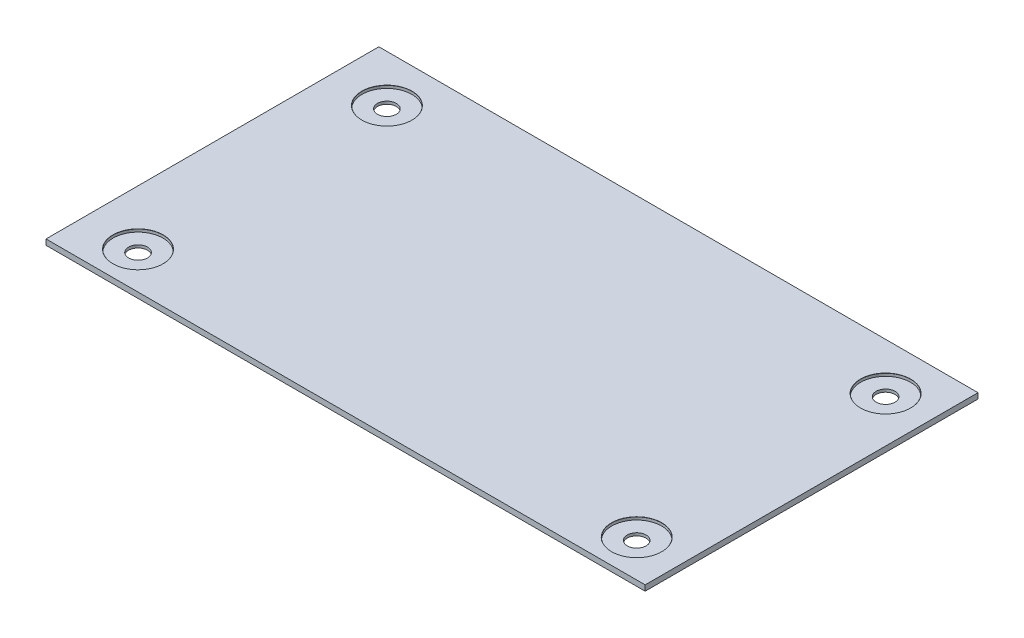
ISO-10303-21;
HEADER;
FILE_DESCRIPTION(('STEP AP214'),'2;1');
FILE_NAME('part.step','',(''),(''),'','','');
FILE_SCHEMA(('AUTOMOTIVE_DESIGN { 1 0 10303 214 1 1 1 1 }'));
ENDSEC;
DATA;
#1=APPLICATION_CONTEXT('core data for automotive mechanical design processes');
#2=APPLICATION_PROTOCOL_DEFINITION('international standard','automotive_design',2000,#1);
#3=PRODUCT_CONTEXT('',#1,'mechanical');
#4=PRODUCT('Part','Part','',(#3));
#5=PRODUCT_RELATED_PRODUCT_CATEGORY('part','',(#4));
#6=PRODUCT_DEFINITION_FORMATION('','',#4);
#7=PRODUCT_DEFINITION_CONTEXT('part definition',#1,'design');
#8=PRODUCT_DEFINITION('design','',#6,#7);
#9=PRODUCT_DEFINITION_SHAPE('','',#8);
#10=(LENGTH_UNIT() NAMED_UNIT(*) SI_UNIT(.MILLI.,.METRE.));
#11=(NAMED_UNIT(*) PLANE_ANGLE_UNIT() SI_UNIT($,.RADIAN.));
#12=(NAMED_UNIT(*) SI_UNIT($,.STERADIAN.) SOLID_ANGLE_UNIT());
#13=UNCERTAINTY_MEASURE_WITH_UNIT(LENGTH_MEASURE(1.E-05),#10,'distance_accuracy_value','');
#14=(GEOMETRIC_REPRESENTATION_CONTEXT(3) GLOBAL_UNCERTAINTY_ASSIGNED_CONTEXT((#13)) GLOBAL_UNIT_ASSIGNED_CONTEXT((#10,
#11,#12)) REPRESENTATION_CONTEXT('',''));
#15=CARTESIAN_POINT('',(0.,0.,0.));
#16=DIRECTION('',(0.,0.,1.));
#17=DIRECTION('',(1.,0.,0.));
#18=AXIS2_PLACEMENT_3D('',#15,#16,#17);
#19=CARTESIAN_POINT('',(-54.,1.,-30.));
#20=DIRECTION('',(1.,0.,0.));
#21=DIRECTION('',(0.,0.,-1.));
#22=AXIS2_PLACEMENT_3D('',#19,#20,#21);
#23=PLANE('',#22);
#24=DIRECTION('',(0.,0.,1.));
#25=VECTOR('',#24,1.);
#26=CARTESIAN_POINT('',(-54.,0.,-30.));
#27=LINE('',#26,#25);
#28=CARTESIAN_POINT('',(-54.,0.,-30.));
#29=VERTEX_POINT('',#28);
#30=CARTESIAN_POINT('',(-54.,0.,30.));
#31=VERTEX_POINT('',#30);
#32=EDGE_CURVE('E98',#29,#31,#27,.T.);
#33=ORIENTED_EDGE('',*,*,#32,.T.);
#34=DIRECTION('',(0.,-1.,0.));
#35=VECTOR('',#34,1.);
#36=CARTESIAN_POINT('',(-54.,1.,30.));
#37=LINE('',#36,#35);
#38=CARTESIAN_POINT('',(-54.,1.,30.));
#39=VERTEX_POINT('',#38);
#40=EDGE_CURVE('E11',#39,#31,#37,.T.);
#41=ORIENTED_EDGE('',*,*,#40,.F.);
#42=DIRECTION('',(0.,0.,1.));
#43=VECTOR('',#42,1.);
#44=CARTESIAN_POINT('',(-54.,1.,-30.));
#45=LINE('',#44,#43);
#46=CARTESIAN_POINT('',(-54.,1.,-30.));
#47=VERTEX_POINT('',#46);
#48=EDGE_CURVE('E86',#47,#39,#45,.T.);
#49=ORIENTED_EDGE('',*,*,#48,.F.);
#50=DIRECTION('',(0.,-1.,0.));
#51=VECTOR('',#50,1.);
#52=CARTESIAN_POINT('',(-54.,1.,-30.));
#53=LINE('',#52,#51);
#54=EDGE_CURVE('E94',#47,#29,#53,.T.);
#55=ORIENTED_EDGE('',*,*,#54,.T.);
#56=EDGE_LOOP('',(#33,#41,#49,#55));
#57=FACE_BOUND('',#56,.T.);
#58=ADVANCED_FACE('F35',(#57),#23,.F.);
#59=CARTESIAN_POINT('',(-54.,1.,30.));
#60=DIRECTION('',(0.,0.,-1.));
#61=DIRECTION('',(-1.,0.,0.));
#62=AXIS2_PLACEMENT_3D('',#59,#60,#61);
#63=PLANE('',#62);
#64=DIRECTION('',(1.,0.,0.));
#65=VECTOR('',#64,1.);
#66=CARTESIAN_POINT('',(-54.,0.,30.));
#67=LINE('',#66,#65);
#68=CARTESIAN_POINT('',(54.,0.,30.));
#69=VERTEX_POINT('',#68);
#70=EDGE_CURVE('E90',#31,#69,#67,.T.);
#71=ORIENTED_EDGE('',*,*,#70,.T.);
#72=DIRECTION('',(0.,-1.,0.));
#73=VECTOR('',#72,1.);
#74=CARTESIAN_POINT('',(54.,1.,30.));
#75=LINE('',#74,#73);
#76=CARTESIAN_POINT('',(54.,1.,30.));
#77=VERTEX_POINT('',#76);
#78=EDGE_CURVE('E43',#77,#69,#75,.T.);
#79=ORIENTED_EDGE('',*,*,#78,.F.);
#80=DIRECTION('',(1.,0.,0.));
#81=VECTOR('',#80,1.);
#82=CARTESIAN_POINT('',(-54.,1.,30.));
#83=LINE('',#82,#81);
#84=EDGE_CURVE('E81',#39,#77,#83,.T.);
#85=ORIENTED_EDGE('',*,*,#84,.F.);
#86=ORIENTED_EDGE('',*,*,#40,.T.);
#87=EDGE_LOOP('',(#71,#79,#85,#86));
#88=FACE_BOUND('',#87,.T.);
#89=ADVANCED_FACE('F89',(#88),#63,.F.);
#90=CARTESIAN_POINT('',(54.,1.,-30.));
#91=DIRECTION('',(-1.,0.,0.));
#92=DIRECTION('',(0.,0.,1.));
#93=AXIS2_PLACEMENT_3D('',#90,#91,#92);
#94=PLANE('',#93);
#95=DIRECTION('',(0.,0.,-1.));
#96=VECTOR('',#95,1.);
#97=CARTESIAN_POINT('',(54.,0.,-30.));
#98=LINE('',#97,#96);
#99=CARTESIAN_POINT('',(54.,0.,-30.));
#100=VERTEX_POINT('',#99);
#101=EDGE_CURVE('E68',#69,#100,#98,.T.);
#102=ORIENTED_EDGE('',*,*,#101,.T.);
#103=DIRECTION('',(0.,-1.,0.));
#104=VECTOR('',#103,1.);
#105=CARTESIAN_POINT('',(54.,1.,-30.));
#106=LINE('',#105,#104);
#107=CARTESIAN_POINT('',(54.,1.,-30.));
#108=VERTEX_POINT('',#107);
#109=EDGE_CURVE('E91',#108,#100,#106,.T.);
#110=ORIENTED_EDGE('',*,*,#109,.F.);
#111=DIRECTION('',(0.,0.,-1.));
#112=VECTOR('',#111,1.);
#113=CARTESIAN_POINT('',(54.,1.,-30.));
#114=LINE('',#113,#112);
#115=EDGE_CURVE('E84',#77,#108,#114,.T.);
#116=ORIENTED_EDGE('',*,*,#115,.F.);
#117=ORIENTED_EDGE('',*,*,#78,.T.);
#118=EDGE_LOOP('',(#102,#110,#116,#117));
#119=FACE_BOUND('',#118,.T.);
#120=ADVANCED_FACE('F92',(#119),#94,.F.);
#121=CARTESIAN_POINT('',(-54.,1.,-30.));
#122=DIRECTION('',(0.,0.,1.));
#123=DIRECTION('',(1.,0.,0.));
#124=AXIS2_PLACEMENT_3D('',#121,#122,#123);
#125=PLANE('',#124);
#126=DIRECTION('',(-1.,0.,0.));
#127=VECTOR('',#126,1.);
#128=CARTESIAN_POINT('',(-54.,0.,-30.));
#129=LINE('',#128,#127);
#130=EDGE_CURVE('E74',#100,#29,#129,.T.);
#131=ORIENTED_EDGE('',*,*,#130,.T.);
#132=ORIENTED_EDGE('',*,*,#54,.F.);
#133=DIRECTION('',(-1.,0.,0.));
#134=VECTOR('',#133,1.);
#135=CARTESIAN_POINT('',(-54.,1.,-30.));
#136=LINE('',#135,#134);
#137=EDGE_CURVE('E51',#108,#47,#136,.T.);
#138=ORIENTED_EDGE('',*,*,#137,.F.);
#139=ORIENTED_EDGE('',*,*,#109,.T.);
#140=EDGE_LOOP('',(#131,#132,#138,#139));
#141=FACE_BOUND('',#140,.T.);
#142=ADVANCED_FACE('F106',(#141),#125,.F.);
#143=CARTESIAN_POINT('',(0.,1.,0.));
#144=DIRECTION('',(0.,1.,0.));
#145=DIRECTION('',(0.,0.,1.));
#146=AXIS2_PLACEMENT_3D('',#143,#144,#145);
#147=PLANE('',#146);
#148=CARTESIAN_POINT('',(-44.0849623429926,1.,-21.5390915492151));
#149=DIRECTION('',(0.,1.,0.));
#150=DIRECTION('',(0.,0.,1.));
#151=AXIS2_PLACEMENT_3D('',#148,#149,#150);
#152=CIRCLE('',#151,4.525);
#153=CARTESIAN_POINT('',(-44.0849623429926,1.,-17.0140915492151));
#154=VERTEX_POINT('',#153);
#155=EDGE_CURVE('E168',#154,#154,#152,.T.);
#156=ORIENTED_EDGE('',*,*,#155,.F.);
#157=EDGE_LOOP('',(#156));
#158=FACE_BOUND('',#157,.T.);
#159=CARTESIAN_POINT('',(45.8031338926475,1.,-21.5390915492151));
#160=DIRECTION('',(0.,1.,0.));
#161=DIRECTION('',(0.,0.,1.));
#162=AXIS2_PLACEMENT_3D('',#159,#160,#161);
#163=CIRCLE('',#162,4.525);
#164=CARTESIAN_POINT('',(45.8031338926475,1.,-17.0140915492151));
#165=VERTEX_POINT('',#164);
#166=EDGE_CURVE('E153',#165,#165,#163,.T.);
#167=ORIENTED_EDGE('',*,*,#166,.F.);
#168=EDGE_LOOP('',(#167));
#169=FACE_BOUND('',#168,.T.);
#170=CARTESIAN_POINT('',(-44.0849623429926,1.,23.3247103117549));
#171=DIRECTION('',(0.,1.,0.));
#172=DIRECTION('',(0.,0.,1.));
#173=AXIS2_PLACEMENT_3D('',#170,#171,#172);
#174=CIRCLE('',#173,4.525);
#175=CARTESIAN_POINT('',(-44.0849623429926,1.,27.8497103117549));
#176=VERTEX_POINT('',#175);
#177=EDGE_CURVE('E138',#176,#176,#174,.T.);
#178=ORIENTED_EDGE('',*,*,#177,.F.);
#179=EDGE_LOOP('',(#178));
#180=FACE_BOUND('',#179,.T.);
#181=CARTESIAN_POINT('',(45.8031338926475,1.,23.3247103117549));
#182=DIRECTION('',(0.,1.,0.));
#183=DIRECTION('',(0.,0.,1.));
#184=AXIS2_PLACEMENT_3D('',#181,#182,#183);
#185=CIRCLE('',#184,4.525);
#186=CARTESIAN_POINT('',(45.8031338926475,1.,27.8497103117549));
#187=VERTEX_POINT('',#186);
#188=EDGE_CURVE('E123',#187,#187,#185,.T.);
#189=ORIENTED_EDGE('',*,*,#188,.F.);
#190=EDGE_LOOP('',(#189));
#191=FACE_BOUND('',#190,.T.);
#192=ORIENTED_EDGE('',*,*,#48,.T.);
#193=ORIENTED_EDGE('',*,*,#84,.T.);
#194=ORIENTED_EDGE('',*,*,#115,.T.);
#195=ORIENTED_EDGE('',*,*,#137,.T.);
#196=EDGE_LOOP('',(#192,#193,#194,#195));
#197=FACE_BOUND('',#196,.T.);
#198=ADVANCED_FACE('F82',(#158,#169,#180,#191,#197),#147,.T.);
#199=CARTESIAN_POINT('',(0.,0.,0.));
#200=DIRECTION('',(0.,1.,0.));
#201=DIRECTION('',(0.,0.,1.));
#202=AXIS2_PLACEMENT_3D('',#199,#200,#201);
#203=PLANE('',#202);
#204=CARTESIAN_POINT('',(-44.0849623429926,0.,-21.5390915492151));
#205=DIRECTION('',(0.,1.,0.));
#206=DIRECTION('',(0.,0.,1.));
#207=AXIS2_PLACEMENT_3D('',#204,#205,#206);
#208=CIRCLE('',#207,1.7);
#209=CARTESIAN_POINT('',(-44.0849623429926,0.,-19.8390915492151));
#210=VERTEX_POINT('',#209);
#211=EDGE_CURVE('E156',#210,#210,#208,.T.);
#212=ORIENTED_EDGE('',*,*,#211,.T.);
#213=EDGE_LOOP('',(#212));
#214=FACE_BOUND('',#213,.T.);
#215=CARTESIAN_POINT('',(45.8031338926475,0.,-21.5390915492151));
#216=DIRECTION('',(0.,1.,0.));
#217=DIRECTION('',(0.,0.,1.));
#218=AXIS2_PLACEMENT_3D('',#215,#216,#217);
#219=CIRCLE('',#218,1.7);
#220=CARTESIAN_POINT('',(45.8031338926475,0.,-19.8390915492151));
#221=VERTEX_POINT('',#220);
#222=EDGE_CURVE('E141',#221,#221,#219,.T.);
#223=ORIENTED_EDGE('',*,*,#222,.T.);
#224=EDGE_LOOP('',(#223));
#225=FACE_BOUND('',#224,.T.);
#226=CARTESIAN_POINT('',(-44.0849623429926,0.,23.3247103117549));
#227=DIRECTION('',(0.,1.,0.));
#228=DIRECTION('',(0.,0.,1.));
#229=AXIS2_PLACEMENT_3D('',#226,#227,#228);
#230=CIRCLE('',#229,1.7);
#231=CARTESIAN_POINT('',(-44.0849623429926,0.,25.0247103117549));
#232=VERTEX_POINT('',#231);
#233=EDGE_CURVE('E126',#232,#232,#230,.T.);
#234=ORIENTED_EDGE('',*,*,#233,.T.);
#235=EDGE_LOOP('',(#234));
#236=FACE_BOUND('',#235,.T.);
#237=CARTESIAN_POINT('',(45.8031338926475,0.,23.3247103117549));
#238=DIRECTION('',(0.,1.,0.));
#239=DIRECTION('',(0.,0.,1.));
#240=AXIS2_PLACEMENT_3D('',#237,#238,#239);
#241=CIRCLE('',#240,1.7);
#242=CARTESIAN_POINT('',(45.8031338926475,0.,25.0247103117549));
#243=VERTEX_POINT('',#242);
#244=EDGE_CURVE('E101',#243,#243,#241,.T.);
#245=ORIENTED_EDGE('',*,*,#244,.T.);
#246=EDGE_LOOP('',(#245));
#247=FACE_BOUND('',#246,.T.);
#248=ORIENTED_EDGE('',*,*,#32,.F.);
#249=ORIENTED_EDGE('',*,*,#130,.F.);
#250=ORIENTED_EDGE('',*,*,#101,.F.);
#251=ORIENTED_EDGE('',*,*,#70,.F.);
#252=EDGE_LOOP('',(#248,#249,#250,#251));
#253=FACE_BOUND('',#252,.T.);
#254=ADVANCED_FACE('F109',(#214,#225,#236,#247,#253),#203,.F.);
#255=CARTESIAN_POINT('',(45.8031338926475,1.,23.3247103117549));
#256=DIRECTION('',(0.,1.,0.));
#257=DIRECTION('',(0.,0.,1.));
#258=AXIS2_PLACEMENT_3D('',#255,#256,#257);
#259=CYLINDRICAL_SURFACE('',#258,1.7);
#260=ORIENTED_EDGE('',*,*,#244,.F.);
#261=EDGE_LOOP('',(#260));
#262=FACE_BOUND('',#261,.T.);
#263=CARTESIAN_POINT('',(45.8031338926475,0.5,23.3247103117549));
#264=DIRECTION('',(0.,1.,0.));
#265=DIRECTION('',(0.,0.,1.));
#266=AXIS2_PLACEMENT_3D('',#263,#264,#265);
#267=CIRCLE('',#266,1.7);
#268=CARTESIAN_POINT('',(45.8031338926475,0.5,25.0247103117549));
#269=VERTEX_POINT('',#268);
#270=EDGE_CURVE('E114',#269,#269,#267,.T.);
#271=ORIENTED_EDGE('',*,*,#270,.T.);
#272=EDGE_LOOP('',(#271));
#273=FACE_BOUND('',#272,.T.);
#274=ADVANCED_FACE('F212',(#262,#273),#259,.F.);
#275=CARTESIAN_POINT('',(50.3031338926475,0.5,23.3247103117549));
#276=DIRECTION('',(0.,-1.,0.));
#277=DIRECTION('',(0.,0.,-1.));
#278=AXIS2_PLACEMENT_3D('',#275,#276,#277);
#279=PLANE('',#278);
#280=ORIENTED_EDGE('',*,*,#270,.F.);
#281=EDGE_LOOP('',(#280));
#282=FACE_BOUND('',#281,.T.);
#283=CARTESIAN_POINT('',(45.8031338926475,0.5,23.3247103117549));
#284=DIRECTION('',(0.,1.,0.));
#285=DIRECTION('',(0.,0.,1.));
#286=AXIS2_PLACEMENT_3D('',#283,#284,#285);
#287=CIRCLE('',#286,4.5);
#288=CARTESIAN_POINT('',(45.8031338926475,0.5,27.8247103117549));
#289=VERTEX_POINT('',#288);
#290=EDGE_CURVE('E117',#289,#289,#287,.T.);
#291=ORIENTED_EDGE('',*,*,#290,.T.);
#292=EDGE_LOOP('',(#291));
#293=FACE_BOUND('',#292,.T.);
#294=ADVANCED_FACE('F196',(#282,#293),#279,.F.);
#295=CARTESIAN_POINT('',(45.8031338926475,1.,23.3247103117549));
#296=DIRECTION('',(0.,1.,0.));
#297=DIRECTION('',(0.,0.,1.));
#298=AXIS2_PLACEMENT_3D('',#295,#296,#297);
#299=CYLINDRICAL_SURFACE('',#298,4.5);
#300=ORIENTED_EDGE('',*,*,#290,.F.);
#301=EDGE_LOOP('',(#300));
#302=FACE_BOUND('',#301,.T.);
#303=CARTESIAN_POINT('',(45.8031338926475,0.975,23.3247103117549));
#304=DIRECTION('',(0.,1.,0.));
#305=DIRECTION('',(0.,0.,1.));
#306=AXIS2_PLACEMENT_3D('',#303,#304,#305);
#307=CIRCLE('',#306,4.5);
#308=CARTESIAN_POINT('',(45.8031338926475,0.975,27.8247103117549));
#309=VERTEX_POINT('',#308);
#310=EDGE_CURVE('E120',#309,#309,#307,.T.);
#311=ORIENTED_EDGE('',*,*,#310,.T.);
#312=EDGE_LOOP('',(#311));
#313=FACE_BOUND('',#312,.T.);
#314=ADVANCED_FACE('F186',(#302,#313),#299,.F.);
#315=CARTESIAN_POINT('',(45.8031338926475,1.,23.3247103117549));
#316=DIRECTION('',(0.,1.,0.));
#317=DIRECTION('',(0.,0.,1.));
#318=AXIS2_PLACEMENT_3D('',#315,#316,#317);
#319=CONICAL_SURFACE('',#318,4.525,0.785398163397388);
#320=ORIENTED_EDGE('',*,*,#310,.F.);
#321=EDGE_LOOP('',(#320));
#322=FACE_BOUND('',#321,.T.);
#323=ORIENTED_EDGE('',*,*,#188,.T.);
#324=EDGE_LOOP('',(#323));
#325=FACE_BOUND('',#324,.T.);
#326=ADVANCED_FACE('F183',(#322,#325),#319,.F.);
#327=CARTESIAN_POINT('',(-44.0849623429926,1.,23.3247103117549));
#328=DIRECTION('',(0.,1.,0.));
#329=DIRECTION('',(0.,0.,1.));
#330=AXIS2_PLACEMENT_3D('',#327,#328,#329);
#331=CYLINDRICAL_SURFACE('',#330,1.7);
#332=ORIENTED_EDGE('',*,*,#233,.F.);
#333=EDGE_LOOP('',(#332));
#334=FACE_BOUND('',#333,.T.);
#335=CARTESIAN_POINT('',(-44.0849623429926,0.5,23.3247103117549));
#336=DIRECTION('',(0.,1.,0.));
#337=DIRECTION('',(0.,0.,1.));
#338=AXIS2_PLACEMENT_3D('',#335,#336,#337);
#339=CIRCLE('',#338,1.7);
#340=CARTESIAN_POINT('',(-44.0849623429926,0.5,25.0247103117549));
#341=VERTEX_POINT('',#340);
#342=EDGE_CURVE('E129',#341,#341,#339,.T.);
#343=ORIENTED_EDGE('',*,*,#342,.T.);
#344=EDGE_LOOP('',(#343));
#345=FACE_BOUND('',#344,.T.);
#346=ADVANCED_FACE('F185',(#334,#345),#331,.F.);
#347=CARTESIAN_POINT('',(-39.5849623429926,0.5,23.3247103117549));
#348=DIRECTION('',(0.,-1.,0.));
#349=DIRECTION('',(0.,0.,-1.));
#350=AXIS2_PLACEMENT_3D('',#347,#348,#349);
#351=PLANE('',#350);
#352=ORIENTED_EDGE('',*,*,#342,.F.);
#353=EDGE_LOOP('',(#352));
#354=FACE_BOUND('',#353,.T.);
#355=CARTESIAN_POINT('',(-44.0849623429926,0.5,23.3247103117549));
#356=DIRECTION('',(0.,1.,0.));
#357=DIRECTION('',(0.,0.,1.));
#358=AXIS2_PLACEMENT_3D('',#355,#356,#357);
#359=CIRCLE('',#358,4.5);
#360=CARTESIAN_POINT('',(-44.0849623429926,0.5,27.8247103117549));
#361=VERTEX_POINT('',#360);
#362=EDGE_CURVE('E132',#361,#361,#359,.T.);
#363=ORIENTED_EDGE('',*,*,#362,.T.);
#364=EDGE_LOOP('',(#363));
#365=FACE_BOUND('',#364,.T.);
#366=ADVANCED_FACE('F193',(#354,#365),#351,.F.);
#367=CARTESIAN_POINT('',(-44.0849623429926,1.,23.3247103117549));
#368=DIRECTION('',(0.,1.,0.));
#369=DIRECTION('',(0.,0.,1.));
#370=AXIS2_PLACEMENT_3D('',#367,#368,#369);
#371=CYLINDRICAL_SURFACE('',#370,4.5);
#372=ORIENTED_EDGE('',*,*,#362,.F.);
#373=EDGE_LOOP('',(#372));
#374=FACE_BOUND('',#373,.T.);
#375=CARTESIAN_POINT('',(-44.0849623429926,0.975,23.3247103117549));
#376=DIRECTION('',(0.,1.,0.));
#377=DIRECTION('',(0.,0.,1.));
#378=AXIS2_PLACEMENT_3D('',#375,#376,#377);
#379=CIRCLE('',#378,4.5);
#380=CARTESIAN_POINT('',(-44.0849623429926,0.975,27.8247103117549));
#381=VERTEX_POINT('',#380);
#382=EDGE_CURVE('E135',#381,#381,#379,.T.);
#383=ORIENTED_EDGE('',*,*,#382,.T.);
#384=EDGE_LOOP('',(#383));
#385=FACE_BOUND('',#384,.T.);
#386=ADVANCED_FACE('F252',(#374,#385),#371,.F.);
#387=CARTESIAN_POINT('',(-44.0849623429926,1.,23.3247103117549));
#388=DIRECTION('',(0.,1.,0.));
#389=DIRECTION('',(0.,0.,1.));
#390=AXIS2_PLACEMENT_3D('',#387,#388,#389);
#391=CONICAL_SURFACE('',#390,4.525,0.785398163397388);
#392=ORIENTED_EDGE('',*,*,#382,.F.);
#393=EDGE_LOOP('',(#392));
#394=FACE_BOUND('',#393,.T.);
#395=ORIENTED_EDGE('',*,*,#177,.T.);
#396=EDGE_LOOP('',(#395));
#397=FACE_BOUND('',#396,.T.);
#398=ADVANCED_FACE('F262',(#394,#397),#391,.F.);
#399=CARTESIAN_POINT('',(45.8031338926475,1.,-21.5390915492151));
#400=DIRECTION('',(0.,1.,0.));
#401=DIRECTION('',(0.,0.,1.));
#402=AXIS2_PLACEMENT_3D('',#399,#400,#401);
#403=CYLINDRICAL_SURFACE('',#402,1.7);
#404=ORIENTED_EDGE('',*,*,#222,.F.);
#405=EDGE_LOOP('',(#404));
#406=FACE_BOUND('',#405,.T.);
#407=CARTESIAN_POINT('',(45.8031338926475,0.5,-21.5390915492151));
#408=DIRECTION('',(0.,1.,0.));
#409=DIRECTION('',(0.,0.,1.));
#410=AXIS2_PLACEMENT_3D('',#407,#408,#409);
#411=CIRCLE('',#410,1.7);
#412=CARTESIAN_POINT('',(45.8031338926475,0.5,-19.8390915492151));
#413=VERTEX_POINT('',#412);
#414=EDGE_CURVE('E144',#413,#413,#411,.T.);
#415=ORIENTED_EDGE('',*,*,#414,.T.);
#416=EDGE_LOOP('',(#415));
#417=FACE_BOUND('',#416,.T.);
#418=ADVANCED_FACE('F272',(#406,#417),#403,.F.);
#419=CARTESIAN_POINT('',(50.3031338926475,0.5,-21.5390915492151));
#420=DIRECTION('',(0.,-1.,0.));
#421=DIRECTION('',(0.,0.,-1.));
#422=AXIS2_PLACEMENT_3D('',#419,#420,#421);
#423=PLANE('',#422);
#424=ORIENTED_EDGE('',*,*,#414,.F.);
#425=EDGE_LOOP('',(#424));
#426=FACE_BOUND('',#425,.T.);
#427=CARTESIAN_POINT('',(45.8031338926475,0.5,-21.5390915492151));
#428=DIRECTION('',(0.,1.,0.));
#429=DIRECTION('',(0.,0.,1.));
#430=AXIS2_PLACEMENT_3D('',#427,#428,#429);
#431=CIRCLE('',#430,4.5);
#432=CARTESIAN_POINT('',(45.8031338926475,0.5,-17.0390915492151));
#433=VERTEX_POINT('',#432);
#434=EDGE_CURVE('E147',#433,#433,#431,.T.);
#435=ORIENTED_EDGE('',*,*,#434,.T.);
#436=EDGE_LOOP('',(#435));
#437=FACE_BOUND('',#436,.T.);
#438=ADVANCED_FACE('F282',(#426,#437),#423,.F.);
#439=CARTESIAN_POINT('',(45.8031338926475,1.,-21.5390915492151));
#440=DIRECTION('',(0.,1.,0.));
#441=DIRECTION('',(0.,0.,1.));
#442=AXIS2_PLACEMENT_3D('',#439,#440,#441);
#443=CYLINDRICAL_SURFACE('',#442,4.5);
#444=ORIENTED_EDGE('',*,*,#434,.F.);
#445=EDGE_LOOP('',(#444));
#446=FACE_BOUND('',#445,.T.);
#447=CARTESIAN_POINT('',(45.8031338926475,0.975,-21.5390915492151));
#448=DIRECTION('',(0.,1.,0.));
#449=DIRECTION('',(0.,0.,1.));
#450=AXIS2_PLACEMENT_3D('',#447,#448,#449);
#451=CIRCLE('',#450,4.5);
#452=CARTESIAN_POINT('',(45.8031338926475,0.975,-17.0390915492151));
#453=VERTEX_POINT('',#452);
#454=EDGE_CURVE('E150',#453,#453,#451,.T.);
#455=ORIENTED_EDGE('',*,*,#454,.T.);
#456=EDGE_LOOP('',(#455));
#457=FACE_BOUND('',#456,.T.);
#458=ADVANCED_FACE('F292',(#446,#457),#443,.F.);
#459=CARTESIAN_POINT('',(45.8031338926475,1.,-21.5390915492151));
#460=DIRECTION('',(0.,1.,0.));
#461=DIRECTION('',(0.,0.,1.));
#462=AXIS2_PLACEMENT_3D('',#459,#460,#461);
#463=CONICAL_SURFACE('',#462,4.525,0.785398163397388);
#464=ORIENTED_EDGE('',*,*,#454,.F.);
#465=EDGE_LOOP('',(#464));
#466=FACE_BOUND('',#465,.T.);
#467=ORIENTED_EDGE('',*,*,#166,.T.);
#468=EDGE_LOOP('',(#467));
#469=FACE_BOUND('',#468,.T.);
#470=ADVANCED_FACE('F302',(#466,#469),#463,.F.);
#471=CARTESIAN_POINT('',(-44.0849623429926,1.,-21.5390915492151));
#472=DIRECTION('',(0.,1.,0.));
#473=DIRECTION('',(0.,0.,1.));
#474=AXIS2_PLACEMENT_3D('',#471,#472,#473);
#475=CYLINDRICAL_SURFACE('',#474,1.7);
#476=ORIENTED_EDGE('',*,*,#211,.F.);
#477=EDGE_LOOP('',(#476));
#478=FACE_BOUND('',#477,.T.);
#479=CARTESIAN_POINT('',(-44.0849623429926,0.5,-21.5390915492151));
#480=DIRECTION('',(0.,1.,0.));
#481=DIRECTION('',(0.,0.,1.));
#482=AXIS2_PLACEMENT_3D('',#479,#480,#481);
#483=CIRCLE('',#482,1.7);
#484=CARTESIAN_POINT('',(-44.0849623429926,0.5,-19.8390915492151));
#485=VERTEX_POINT('',#484);
#486=EDGE_CURVE('E159',#485,#485,#483,.T.);
#487=ORIENTED_EDGE('',*,*,#486,.T.);
#488=EDGE_LOOP('',(#487));
#489=FACE_BOUND('',#488,.T.);
#490=ADVANCED_FACE('F312',(#478,#489),#475,.F.);
#491=CARTESIAN_POINT('',(-39.5849623429926,0.5,-21.5390915492151));
#492=DIRECTION('',(0.,-1.,0.));
#493=DIRECTION('',(0.,0.,-1.));
#494=AXIS2_PLACEMENT_3D('',#491,#492,#493);
#495=PLANE('',#494);
#496=ORIENTED_EDGE('',*,*,#486,.F.);
#497=EDGE_LOOP('',(#496));
#498=FACE_BOUND('',#497,.T.);
#499=CARTESIAN_POINT('',(-44.0849623429926,0.5,-21.5390915492151));
#500=DIRECTION('',(0.,1.,0.));
#501=DIRECTION('',(0.,0.,1.));
#502=AXIS2_PLACEMENT_3D('',#499,#500,#501);
#503=CIRCLE('',#502,4.5);
#504=CARTESIAN_POINT('',(-44.0849623429926,0.5,-17.0390915492151));
#505=VERTEX_POINT('',#504);
#506=EDGE_CURVE('E162',#505,#505,#503,.T.);
#507=ORIENTED_EDGE('',*,*,#506,.T.);
#508=EDGE_LOOP('',(#507));
#509=FACE_BOUND('',#508,.T.);
#510=ADVANCED_FACE('F322',(#498,#509),#495,.F.);
#511=CARTESIAN_POINT('',(-44.0849623429926,1.,-21.5390915492151));
#512=DIRECTION('',(0.,1.,0.));
#513=DIRECTION('',(0.,0.,1.));
#514=AXIS2_PLACEMENT_3D('',#511,#512,#513);
#515=CYLINDRICAL_SURFACE('',#514,4.5);
#516=ORIENTED_EDGE('',*,*,#506,.F.);
#517=EDGE_LOOP('',(#516));
#518=FACE_BOUND('',#517,.T.);
#519=CARTESIAN_POINT('',(-44.0849623429926,0.975,-21.5390915492151));
#520=DIRECTION('',(0.,1.,0.));
#521=DIRECTION('',(0.,0.,1.));
#522=AXIS2_PLACEMENT_3D('',#519,#520,#521);
#523=CIRCLE('',#522,4.5);
#524=CARTESIAN_POINT('',(-44.0849623429926,0.975,-17.0390915492151));
#525=VERTEX_POINT('',#524);
#526=EDGE_CURVE('E165',#525,#525,#523,.T.);
#527=ORIENTED_EDGE('',*,*,#526,.T.);
#528=EDGE_LOOP('',(#527));
#529=FACE_BOUND('',#528,.T.);
#530=ADVANCED_FACE('F332',(#518,#529),#515,.F.);
#531=CARTESIAN_POINT('',(-44.0849623429926,1.,-21.5390915492151));
#532=DIRECTION('',(0.,1.,0.));
#533=DIRECTION('',(0.,0.,1.));
#534=AXIS2_PLACEMENT_3D('',#531,#532,#533);
#535=CONICAL_SURFACE('',#534,4.525,0.785398163397388);
#536=ORIENTED_EDGE('',*,*,#526,.F.);
#537=EDGE_LOOP('',(#536));
#538=FACE_BOUND('',#537,.T.);
#539=ORIENTED_EDGE('',*,*,#155,.T.);
#540=EDGE_LOOP('',(#539));
#541=FACE_BOUND('',#540,.T.);
#542=ADVANCED_FACE('F172',(#538,#541),#535,.F.);
#543=CLOSED_SHELL('',(#58,#89,#120,#142,#198,#254,#274,#294,#314,#326,#346,#366,#386,#398,#418,
#438,#458,#470,#490,#510,#530,#542));
#544=MANIFOLD_SOLID_BREP('B2',#543);
#545=ADVANCED_BREP_SHAPE_REPRESENTATION('',(#18,#544),#14);
#546=SHAPE_DEFINITION_REPRESENTATION(#9,#545);
ENDSEC;
END-ISO-10303-21;
